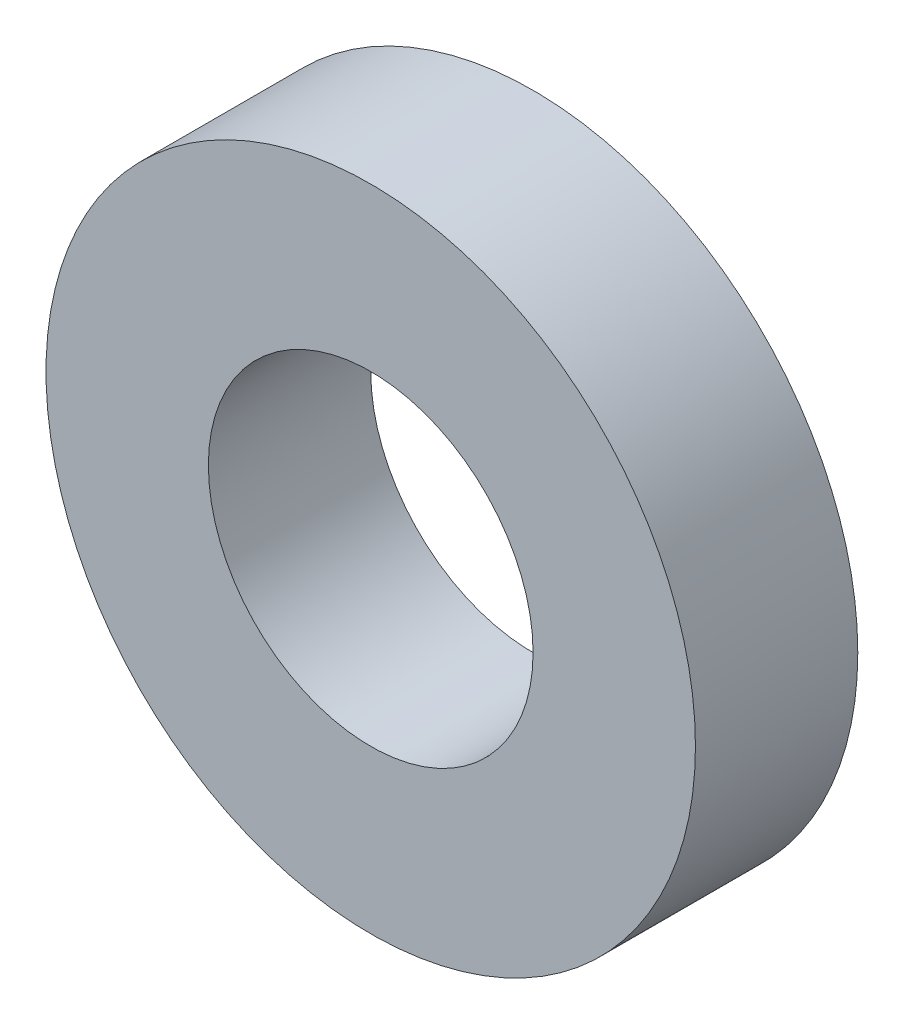
ISO-10303-21;
HEADER;
FILE_DESCRIPTION(('STEP AP214'),'2;1');
FILE_NAME('part.step','',(''),(''),'','','');
FILE_SCHEMA(('AUTOMOTIVE_DESIGN { 1 0 10303 214 1 1 1 1 }'));
ENDSEC;
DATA;
#1=APPLICATION_CONTEXT('core data for automotive mechanical design processes');
#2=APPLICATION_PROTOCOL_DEFINITION('international standard','automotive_design',2000,#1);
#3=PRODUCT_CONTEXT('',#1,'mechanical');
#4=PRODUCT('Part','Part','',(#3));
#5=PRODUCT_RELATED_PRODUCT_CATEGORY('part','',(#4));
#6=PRODUCT_DEFINITION_FORMATION('','',#4);
#7=PRODUCT_DEFINITION_CONTEXT('part definition',#1,'design');
#8=PRODUCT_DEFINITION('design','',#6,#7);
#9=PRODUCT_DEFINITION_SHAPE('','',#8);
#10=(LENGTH_UNIT() NAMED_UNIT(*) SI_UNIT(.MILLI.,.METRE.));
#11=(NAMED_UNIT(*) PLANE_ANGLE_UNIT() SI_UNIT($,.RADIAN.));
#12=(NAMED_UNIT(*) SI_UNIT($,.STERADIAN.) SOLID_ANGLE_UNIT());
#13=UNCERTAINTY_MEASURE_WITH_UNIT(LENGTH_MEASURE(1.E-05),#10,'distance_accuracy_value','');
#14=(GEOMETRIC_REPRESENTATION_CONTEXT(3) GLOBAL_UNCERTAINTY_ASSIGNED_CONTEXT((#13)) GLOBAL_UNIT_ASSIGNED_CONTEXT((#10,
#11,#12)) REPRESENTATION_CONTEXT('',''));
#15=CARTESIAN_POINT('',(0.,0.,0.));
#16=DIRECTION('',(0.,0.,1.));
#17=DIRECTION('',(1.,0.,0.));
#18=AXIS2_PLACEMENT_3D('',#15,#16,#17);
#19=CARTESIAN_POINT('',(0.,0.,3.));
#20=DIRECTION('',(0.,0.,1.));
#21=DIRECTION('',(1.,0.,0.));
#22=AXIS2_PLACEMENT_3D('',#19,#20,#21);
#23=PLANE('',#22);
#24=CARTESIAN_POINT('',(0.,0.,3.));
#25=DIRECTION('',(0.,0.,1.));
#26=DIRECTION('',(1.,0.,0.));
#27=AXIS2_PLACEMENT_3D('',#24,#25,#26);
#28=CIRCLE('',#27,6.);
#29=CARTESIAN_POINT('',(6.,0.,3.));
#30=VERTEX_POINT('',#29);
#31=EDGE_CURVE('E10',#30,#30,#28,.T.);
#32=ORIENTED_EDGE('',*,*,#31,.T.);
#33=EDGE_LOOP('',(#32));
#34=FACE_BOUND('',#33,.T.);
#35=CARTESIAN_POINT('',(0.,0.,3.));
#36=DIRECTION('',(0.,0.,1.));
#37=DIRECTION('',(1.,0.,0.));
#38=AXIS2_PLACEMENT_3D('',#35,#36,#37);
#39=CIRCLE('',#38,3.);
#40=CARTESIAN_POINT('',(3.,0.,3.));
#41=VERTEX_POINT('',#40);
#42=EDGE_CURVE('E44',#41,#41,#39,.T.);
#43=ORIENTED_EDGE('',*,*,#42,.F.);
#44=EDGE_LOOP('',(#43));
#45=FACE_BOUND('',#44,.T.);
#46=ADVANCED_FACE('F33',(#34,#45),#23,.T.);
#47=CARTESIAN_POINT('',(0.,0.,0.));
#48=DIRECTION('',(0.,0.,1.));
#49=DIRECTION('',(1.,0.,0.));
#50=AXIS2_PLACEMENT_3D('',#47,#48,#49);
#51=PLANE('',#50);
#52=CARTESIAN_POINT('',(0.,0.,0.));
#53=DIRECTION('',(0.,0.,1.));
#54=DIRECTION('',(1.,0.,0.));
#55=AXIS2_PLACEMENT_3D('',#52,#53,#54);
#56=CIRCLE('',#55,6.);
#57=CARTESIAN_POINT('',(6.,0.,0.));
#58=VERTEX_POINT('',#57);
#59=EDGE_CURVE('E37',#58,#58,#56,.T.);
#60=ORIENTED_EDGE('',*,*,#59,.F.);
#61=EDGE_LOOP('',(#60));
#62=FACE_BOUND('',#61,.T.);
#63=CARTESIAN_POINT('',(0.,0.,0.));
#64=DIRECTION('',(0.,0.,1.));
#65=DIRECTION('',(1.,0.,0.));
#66=AXIS2_PLACEMENT_3D('',#63,#64,#65);
#67=CIRCLE('',#66,3.);
#68=CARTESIAN_POINT('',(3.,0.,0.));
#69=VERTEX_POINT('',#68);
#70=EDGE_CURVE('E46',#69,#69,#67,.T.);
#71=ORIENTED_EDGE('',*,*,#70,.T.);
#72=EDGE_LOOP('',(#71));
#73=FACE_BOUND('',#72,.T.);
#74=ADVANCED_FACE('F56',(#62,#73),#51,.F.);
#75=CARTESIAN_POINT('',(0.,0.,3.));
#76=DIRECTION('',(0.,0.,-1.));
#77=DIRECTION('',(-1.,0.,0.));
#78=AXIS2_PLACEMENT_3D('',#75,#76,#77);
#79=CYLINDRICAL_SURFACE('',#78,6.);
#80=ORIENTED_EDGE('',*,*,#31,.F.);
#81=EDGE_LOOP('',(#80));
#82=FACE_BOUND('',#81,.T.);
#83=ORIENTED_EDGE('',*,*,#59,.T.);
#84=EDGE_LOOP('',(#83));
#85=FACE_BOUND('',#84,.T.);
#86=ADVANCED_FACE('F35',(#82,#85),#79,.T.);
#87=CARTESIAN_POINT('',(0.,0.,3.));
#88=DIRECTION('',(0.,0.,-1.));
#89=DIRECTION('',(-1.,0.,0.));
#90=AXIS2_PLACEMENT_3D('',#87,#88,#89);
#91=CYLINDRICAL_SURFACE('',#90,3.);
#92=ORIENTED_EDGE('',*,*,#42,.T.);
#93=EDGE_LOOP('',(#92));
#94=FACE_BOUND('',#93,.T.);
#95=ORIENTED_EDGE('',*,*,#70,.F.);
#96=EDGE_LOOP('',(#95));
#97=FACE_BOUND('',#96,.T.);
#98=ADVANCED_FACE('F52',(#94,#97),#91,.F.);
#99=CLOSED_SHELL('',(#46,#74,#86,#98));
#100=MANIFOLD_SOLID_BREP('B2',#99);
#101=ADVANCED_BREP_SHAPE_REPRESENTATION('',(#18,#100),#14);
#102=SHAPE_DEFINITION_REPRESENTATION(#9,#101);
ENDSEC;
END-ISO-10303-21;
